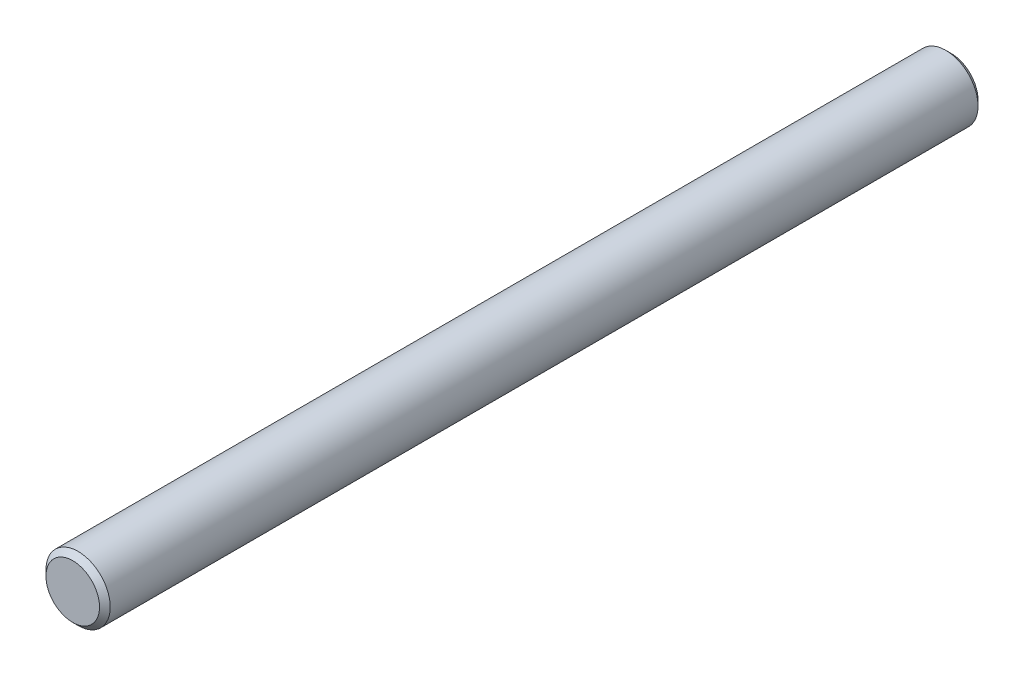
ISO-10303-21;
HEADER;
FILE_DESCRIPTION(('STEP AP214'),'2;1');
FILE_NAME('part.step','',(''),(''),'','','');
FILE_SCHEMA(('AUTOMOTIVE_DESIGN { 1 0 10303 214 1 1 1 1 }'));
ENDSEC;
DATA;
#1=APPLICATION_CONTEXT('core data for automotive mechanical design processes');
#2=APPLICATION_PROTOCOL_DEFINITION('international standard','automotive_design',2000,#1);
#3=PRODUCT_CONTEXT('',#1,'mechanical');
#4=PRODUCT('Part','Part','',(#3));
#5=PRODUCT_RELATED_PRODUCT_CATEGORY('part','',(#4));
#6=PRODUCT_DEFINITION_FORMATION('','',#4);
#7=PRODUCT_DEFINITION_CONTEXT('part definition',#1,'design');
#8=PRODUCT_DEFINITION('design','',#6,#7);
#9=PRODUCT_DEFINITION_SHAPE('','',#8);
#10=(LENGTH_UNIT() NAMED_UNIT(*) SI_UNIT(.MILLI.,.METRE.));
#11=(NAMED_UNIT(*) PLANE_ANGLE_UNIT() SI_UNIT($,.RADIAN.));
#12=(NAMED_UNIT(*) SI_UNIT($,.STERADIAN.) SOLID_ANGLE_UNIT());
#13=UNCERTAINTY_MEASURE_WITH_UNIT(LENGTH_MEASURE(1.E-05),#10,'distance_accuracy_value','');
#14=(GEOMETRIC_REPRESENTATION_CONTEXT(3) GLOBAL_UNCERTAINTY_ASSIGNED_CONTEXT((#13)) GLOBAL_UNIT_ASSIGNED_CONTEXT((#10,
#11,#12)) REPRESENTATION_CONTEXT('',''));
#15=CARTESIAN_POINT('',(0.,0.,0.));
#16=DIRECTION('',(0.,0.,1.));
#17=DIRECTION('',(1.,0.,0.));
#18=AXIS2_PLACEMENT_3D('',#15,#16,#17);
#19=CARTESIAN_POINT('',(0.,0.,41.));
#20=DIRECTION('',(0.,0.,-1.));
#21=DIRECTION('',(-1.,0.,0.));
#22=AXIS2_PLACEMENT_3D('',#19,#20,#21);
#23=CYLINDRICAL_SURFACE('',#22,3.);
#24=CARTESIAN_POINT('',(0.,0.,-40.5));
#25=DIRECTION('',(0.,0.,1.));
#26=DIRECTION('',(1.,0.,0.));
#27=AXIS2_PLACEMENT_3D('',#24,#25,#26);
#28=CIRCLE('',#27,3.);
#29=CARTESIAN_POINT('',(3.,0.,-40.5));
#30=VERTEX_POINT('',#29);
#31=EDGE_CURVE('E61',#30,#30,#28,.T.);
#32=ORIENTED_EDGE('',*,*,#31,.T.);
#33=EDGE_LOOP('',(#32));
#34=FACE_BOUND('',#33,.T.);
#35=CARTESIAN_POINT('',(0.,0.,40.5));
#36=DIRECTION('',(0.,0.,1.));
#37=DIRECTION('',(1.,0.,0.));
#38=AXIS2_PLACEMENT_3D('',#35,#36,#37);
#39=CIRCLE('',#38,3.);
#40=CARTESIAN_POINT('',(3.,0.,40.5));
#41=VERTEX_POINT('',#40);
#42=EDGE_CURVE('E66',#41,#41,#39,.F.);
#43=ORIENTED_EDGE('',*,*,#42,.T.);
#44=EDGE_LOOP('',(#43));
#45=FACE_BOUND('',#44,.T.);
#46=ADVANCED_FACE('F47',(#34,#45),#23,.T.);
#47=CARTESIAN_POINT('',(0.,0.,41.));
#48=DIRECTION('',(0.,0.,1.));
#49=DIRECTION('',(1.,0.,0.));
#50=AXIS2_PLACEMENT_3D('',#47,#48,#49);
#51=PLANE('',#50);
#52=CARTESIAN_POINT('',(0.,0.,41.));
#53=DIRECTION('',(0.,0.,1.));
#54=DIRECTION('',(1.,0.,0.));
#55=AXIS2_PLACEMENT_3D('',#52,#53,#54);
#56=CIRCLE('',#55,2.50000000000002);
#57=CARTESIAN_POINT('',(2.50000000000002,0.,41.));
#58=VERTEX_POINT('',#57);
#59=EDGE_CURVE('E10',#58,#58,#56,.T.);
#60=ORIENTED_EDGE('',*,*,#59,.T.);
#61=EDGE_LOOP('',(#60));
#62=FACE_BOUND('',#61,.T.);
#63=ADVANCED_FACE('F83',(#62),#51,.T.);
#64=CARTESIAN_POINT('',(0.,0.,-41.));
#65=DIRECTION('',(0.,0.,1.));
#66=DIRECTION('',(1.,0.,0.));
#67=AXIS2_PLACEMENT_3D('',#64,#65,#66);
#68=PLANE('',#67);
#69=CARTESIAN_POINT('',(0.,0.,-41.));
#70=DIRECTION('',(0.,0.,1.));
#71=DIRECTION('',(1.,0.,0.));
#72=AXIS2_PLACEMENT_3D('',#69,#70,#71);
#73=CIRCLE('',#72,2.49999999999997);
#74=CARTESIAN_POINT('',(2.49999999999997,0.,-41.));
#75=VERTEX_POINT('',#74);
#76=EDGE_CURVE('E56',#75,#75,#73,.F.);
#77=ORIENTED_EDGE('',*,*,#76,.T.);
#78=EDGE_LOOP('',(#77));
#79=FACE_BOUND('',#78,.T.);
#80=ADVANCED_FACE('F80',(#79),#68,.F.);
#81=CARTESIAN_POINT('',(0.,0.,-40.5));
#82=DIRECTION('',(0.,0.,1.));
#83=DIRECTION('',(1.,0.,0.));
#84=AXIS2_PLACEMENT_3D('',#81,#82,#83);
#85=CONICAL_SURFACE('',#84,3.,0.78539816339746);
#86=ORIENTED_EDGE('',*,*,#76,.F.);
#87=EDGE_LOOP('',(#86));
#88=FACE_BOUND('',#87,.T.);
#89=ORIENTED_EDGE('',*,*,#31,.F.);
#90=EDGE_LOOP('',(#89));
#91=FACE_BOUND('',#90,.T.);
#92=ADVANCED_FACE('F76',(#88,#91),#85,.T.);
#93=CARTESIAN_POINT('',(0.,0.,41.));
#94=DIRECTION('',(0.,0.,-1.));
#95=DIRECTION('',(-1.,0.,0.));
#96=AXIS2_PLACEMENT_3D('',#93,#94,#95);
#97=CONICAL_SURFACE('',#96,2.50000000000002,0.785398163397446);
#98=ORIENTED_EDGE('',*,*,#42,.F.);
#99=EDGE_LOOP('',(#98));
#100=FACE_BOUND('',#99,.T.);
#101=ORIENTED_EDGE('',*,*,#59,.F.);
#102=EDGE_LOOP('',(#101));
#103=FACE_BOUND('',#102,.T.);
#104=ADVANCED_FACE('F50',(#100,#103),#97,.T.);
#105=CLOSED_SHELL('',(#46,#63,#80,#92,#104));
#106=MANIFOLD_SOLID_BREP('B2',#105);
#107=ADVANCED_BREP_SHAPE_REPRESENTATION('',(#18,#106),#14);
#108=SHAPE_DEFINITION_REPRESENTATION(#9,#107);
ENDSEC;
END-ISO-10303-21;
